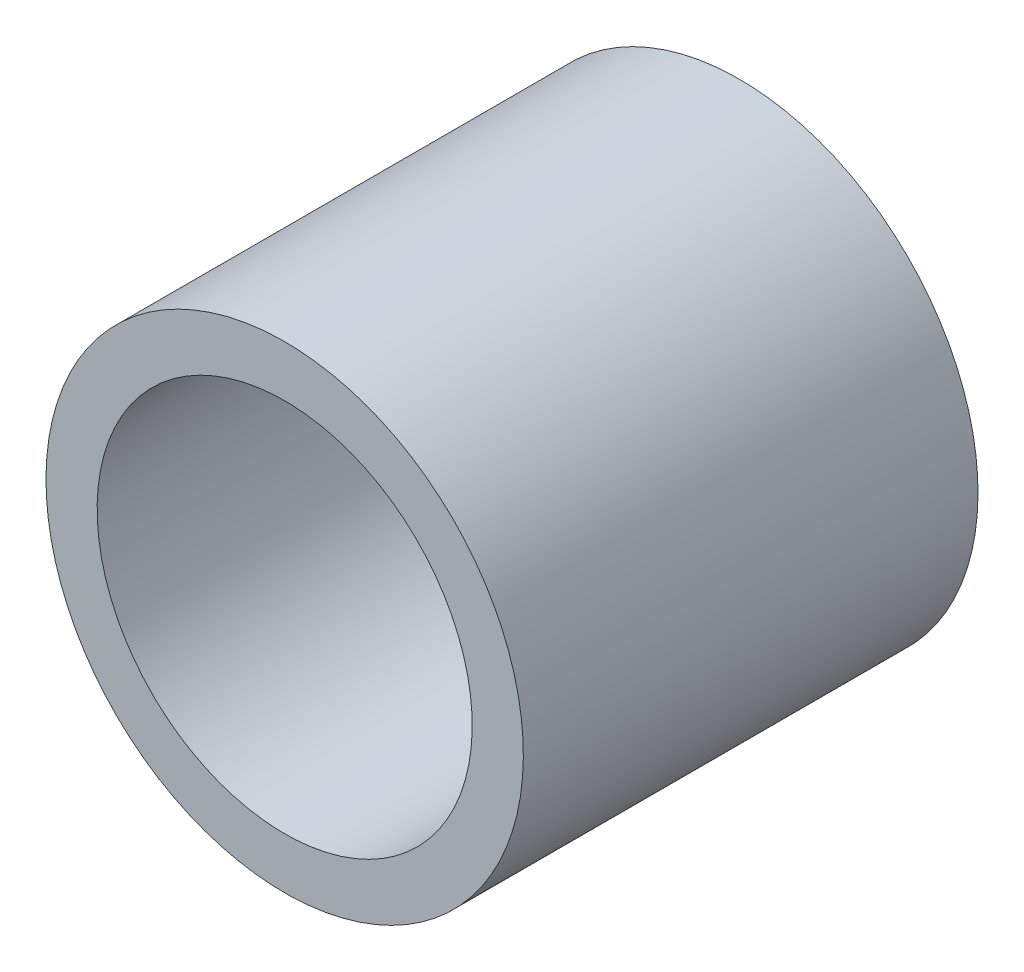
ISO-10303-21;
HEADER;
FILE_DESCRIPTION(('STEP AP214'),'2;1');
FILE_NAME('part.step','',(''),(''),'','','');
FILE_SCHEMA(('AUTOMOTIVE_DESIGN { 1 0 10303 214 1 1 1 1 }'));
ENDSEC;
DATA;
#1=APPLICATION_CONTEXT('core data for automotive mechanical design processes');
#2=APPLICATION_PROTOCOL_DEFINITION('international standard','automotive_design',2000,#1);
#3=PRODUCT_CONTEXT('',#1,'mechanical');
#4=PRODUCT('Part','Part','',(#3));
#5=PRODUCT_RELATED_PRODUCT_CATEGORY('part','',(#4));
#6=PRODUCT_DEFINITION_FORMATION('','',#4);
#7=PRODUCT_DEFINITION_CONTEXT('part definition',#1,'design');
#8=PRODUCT_DEFINITION('design','',#6,#7);
#9=PRODUCT_DEFINITION_SHAPE('','',#8);
#10=(LENGTH_UNIT() NAMED_UNIT(*) SI_UNIT(.MILLI.,.METRE.));
#11=(NAMED_UNIT(*) PLANE_ANGLE_UNIT() SI_UNIT($,.RADIAN.));
#12=(NAMED_UNIT(*) SI_UNIT($,.STERADIAN.) SOLID_ANGLE_UNIT());
#13=UNCERTAINTY_MEASURE_WITH_UNIT(LENGTH_MEASURE(1.E-05),#10,'distance_accuracy_value','');
#14=(GEOMETRIC_REPRESENTATION_CONTEXT(3) GLOBAL_UNCERTAINTY_ASSIGNED_CONTEXT((#13)) GLOBAL_UNIT_ASSIGNED_CONTEXT((#10,
#11,#12)) REPRESENTATION_CONTEXT('',''));
#15=CARTESIAN_POINT('',(0.,0.,0.));
#16=DIRECTION('',(0.,0.,1.));
#17=DIRECTION('',(1.,0.,0.));
#18=AXIS2_PLACEMENT_3D('',#15,#16,#17);
#19=CARTESIAN_POINT('',(0.,-7.49999999999917,15.5));
#20=DIRECTION('',(0.,0.,1.));
#21=DIRECTION('',(1.,0.,0.));
#22=AXIS2_PLACEMENT_3D('',#19,#20,#21);
#23=PLANE('',#22);
#24=CARTESIAN_POINT('',(0.,-7.49999999999917,15.5));
#25=DIRECTION('',(0.,0.,1.));
#26=DIRECTION('',(-0.866025403784438,0.5,0.));
#27=AXIS2_PLACEMENT_3D('',#24,#25,#26);
#28=CIRCLE('',#27,0.825);
#29=CARTESIAN_POINT('',(-0.714470958122237,-7.08749999999917,15.5));
#30=VERTEX_POINT('',#29);
#31=EDGE_CURVE('E11',#30,#30,#28,.T.);
#32=ORIENTED_EDGE('',*,*,#31,.T.);
#33=EDGE_LOOP('',(#32));
#34=FACE_BOUND('',#33,.T.);
#35=CARTESIAN_POINT('',(0.,-7.49999999999917,15.5));
#36=DIRECTION('',(0.,0.,1.));
#37=DIRECTION('',(-0.866025403784438,0.5,0.));
#38=AXIS2_PLACEMENT_3D('',#35,#36,#37);
#39=CIRCLE('',#38,1.05);
#40=CARTESIAN_POINT('',(-0.909326673973736,-6.97499999999917,15.5));
#41=VERTEX_POINT('',#40);
#42=EDGE_CURVE('E53',#41,#41,#39,.T.);
#43=ORIENTED_EDGE('',*,*,#42,.F.);
#44=EDGE_LOOP('',(#43));
#45=FACE_BOUND('',#44,.T.);
#46=ADVANCED_FACE('F16',(#34,#45),#23,.F.);
#47=CARTESIAN_POINT('',(0.,-7.49999999999917,17.5));
#48=DIRECTION('',(0.,0.,1.));
#49=DIRECTION('',(1.,0.,0.));
#50=AXIS2_PLACEMENT_3D('',#47,#48,#49);
#51=PLANE('',#50);
#52=CARTESIAN_POINT('',(0.,-7.49999999999917,17.5));
#53=DIRECTION('',(0.,0.,1.));
#54=DIRECTION('',(-0.866025403784438,0.5,0.));
#55=AXIS2_PLACEMENT_3D('',#52,#53,#54);
#56=CIRCLE('',#55,0.825);
#57=CARTESIAN_POINT('',(-0.714470958122237,-7.08749999999917,17.5));
#58=VERTEX_POINT('',#57);
#59=EDGE_CURVE('E24',#58,#58,#56,.T.);
#60=ORIENTED_EDGE('',*,*,#59,.F.);
#61=EDGE_LOOP('',(#60));
#62=FACE_BOUND('',#61,.T.);
#63=CARTESIAN_POINT('',(0.,-7.49999999999917,17.5));
#64=DIRECTION('',(0.,0.,1.));
#65=DIRECTION('',(-0.866025403784438,0.5,0.));
#66=AXIS2_PLACEMENT_3D('',#63,#64,#65);
#67=CIRCLE('',#66,1.05);
#68=CARTESIAN_POINT('',(-0.909326673973736,-6.97499999999917,17.5));
#69=VERTEX_POINT('',#68);
#70=EDGE_CURVE('E49',#69,#69,#67,.T.);
#71=ORIENTED_EDGE('',*,*,#70,.T.);
#72=EDGE_LOOP('',(#71));
#73=FACE_BOUND('',#72,.T.);
#74=ADVANCED_FACE('F50',(#62,#73),#51,.T.);
#75=CARTESIAN_POINT('',(0.,-7.49999999999917,17.5));
#76=DIRECTION('',(0.,0.,-1.));
#77=DIRECTION('',(-0.866025403784438,0.5,0.));
#78=AXIS2_PLACEMENT_3D('',#75,#76,#77);
#79=CYLINDRICAL_SURFACE('',#78,0.825);
#80=ORIENTED_EDGE('',*,*,#31,.F.);
#81=EDGE_LOOP('',(#80));
#82=FACE_BOUND('',#81,.T.);
#83=ORIENTED_EDGE('',*,*,#59,.T.);
#84=EDGE_LOOP('',(#83));
#85=FACE_BOUND('',#84,.T.);
#86=ADVANCED_FACE('F70',(#82,#85),#79,.F.);
#87=CARTESIAN_POINT('',(0.,-7.49999999999917,17.5));
#88=DIRECTION('',(0.,0.,-1.));
#89=DIRECTION('',(-0.866025403784438,0.5,0.));
#90=AXIS2_PLACEMENT_3D('',#87,#88,#89);
#91=CYLINDRICAL_SURFACE('',#90,1.05);
#92=ORIENTED_EDGE('',*,*,#42,.T.);
#93=EDGE_LOOP('',(#92));
#94=FACE_BOUND('',#93,.T.);
#95=ORIENTED_EDGE('',*,*,#70,.F.);
#96=EDGE_LOOP('',(#95));
#97=FACE_BOUND('',#96,.T.);
#98=ADVANCED_FACE('F65',(#94,#97),#91,.T.);
#99=CLOSED_SHELL('',(#46,#74,#86,#98));
#100=MANIFOLD_SOLID_BREP('B1',#99);
#101=ADVANCED_BREP_SHAPE_REPRESENTATION('',(#18,#100),#14);
#102=SHAPE_DEFINITION_REPRESENTATION(#9,#101);
ENDSEC;
END-ISO-10303-21;
